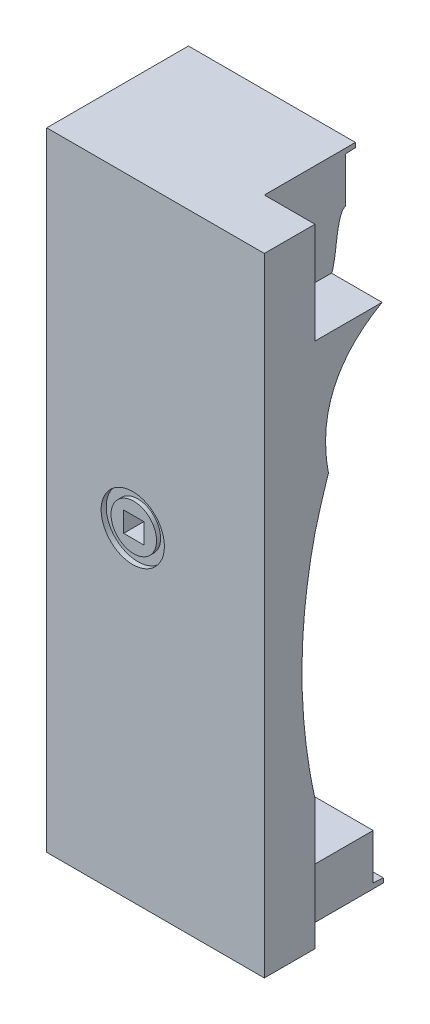
ISO-10303-21;
HEADER;
FILE_DESCRIPTION(('STEP AP214'),'2;1');
FILE_NAME('part.step','',(''),(''),'','','');
FILE_SCHEMA(('AUTOMOTIVE_DESIGN { 1 0 10303 214 1 1 1 1 }'));
ENDSEC;
DATA;
#1=APPLICATION_CONTEXT('core data for automotive mechanical design processes');
#2=APPLICATION_PROTOCOL_DEFINITION('international standard','automotive_design',2000,#1);
#3=PRODUCT_CONTEXT('',#1,'mechanical');
#4=PRODUCT('Part','Part','',(#3));
#5=PRODUCT_RELATED_PRODUCT_CATEGORY('part','',(#4));
#6=PRODUCT_DEFINITION_FORMATION('','',#4);
#7=PRODUCT_DEFINITION_CONTEXT('part definition',#1,'design');
#8=PRODUCT_DEFINITION('design','',#6,#7);
#9=PRODUCT_DEFINITION_SHAPE('','',#8);
#10=(LENGTH_UNIT() NAMED_UNIT(*) SI_UNIT(.MILLI.,.METRE.));
#11=(NAMED_UNIT(*) PLANE_ANGLE_UNIT() SI_UNIT($,.RADIAN.));
#12=(NAMED_UNIT(*) SI_UNIT($,.STERADIAN.) SOLID_ANGLE_UNIT());
#13=UNCERTAINTY_MEASURE_WITH_UNIT(LENGTH_MEASURE(1.E-05),#10,'distance_accuracy_value','');
#14=(GEOMETRIC_REPRESENTATION_CONTEXT(3) GLOBAL_UNCERTAINTY_ASSIGNED_CONTEXT((#13)) GLOBAL_UNIT_ASSIGNED_CONTEXT((#10,
#11,#12)) REPRESENTATION_CONTEXT('',''));
#15=CARTESIAN_POINT('',(0.,0.,0.));
#16=DIRECTION('',(0.,0.,1.));
#17=DIRECTION('',(1.,0.,0.));
#18=AXIS2_PLACEMENT_3D('',#15,#16,#17);
#19=CARTESIAN_POINT('',(0.,0.,26.));
#20=DIRECTION('',(0.,0.,1.));
#21=DIRECTION('',(1.,0.,0.));
#22=AXIS2_PLACEMENT_3D('',#19,#20,#21);
#23=PLANE('',#22);
#24=DIRECTION('',(0.,1.,0.));
#25=VECTOR('',#24,1.);
#26=CARTESIAN_POINT('',(38.5,0.,26.));
#27=LINE('',#26,#25);
#28=CARTESIAN_POINT('',(38.5,1.,26.));
#29=VERTEX_POINT('',#28);
#30=CARTESIAN_POINT('',(38.5,10.,26.));
#31=VERTEX_POINT('',#30);
#32=EDGE_CURVE('E296',#29,#31,#27,.T.);
#33=ORIENTED_EDGE('',*,*,#32,.F.);
#34=DIRECTION('',(-1.,0.,0.));
#35=VECTOR('',#34,1.);
#36=CARTESIAN_POINT('',(0.,1.,26.));
#37=LINE('',#36,#35);
#38=CARTESIAN_POINT('',(1.,1.,26.));
#39=VERTEX_POINT('',#38);
#40=EDGE_CURVE('E238',#29,#39,#37,.T.);
#41=ORIENTED_EDGE('',*,*,#40,.T.);
#42=DIRECTION('',(0.,-1.,0.));
#43=VECTOR('',#42,1.);
#44=CARTESIAN_POINT('',(1.,0.,26.));
#45=LINE('',#44,#43);
#46=CARTESIAN_POINT('',(0.999999999999972,123.,26.));
#47=VERTEX_POINT('',#46);
#48=EDGE_CURVE('E256',#47,#39,#45,.T.);
#49=ORIENTED_EDGE('',*,*,#48,.F.);
#50=DIRECTION('',(-1.,0.,0.));
#51=VECTOR('',#50,1.);
#52=CARTESIAN_POINT('',(0.,123.,26.));
#53=LINE('',#52,#51);
#54=CARTESIAN_POINT('',(33.,123.,26.));
#55=VERTEX_POINT('',#54);
#56=EDGE_CURVE('E254',#55,#47,#53,.T.);
#57=ORIENTED_EDGE('',*,*,#56,.F.);
#58=DIRECTION('',(0.,1.,0.));
#59=VECTOR('',#58,1.);
#60=CARTESIAN_POINT('',(33.,124.,26.));
#61=LINE('',#60,#59);
#62=CARTESIAN_POINT('',(33.,114.,26.));
#63=VERTEX_POINT('',#62);
#64=EDGE_CURVE('E305',#63,#55,#61,.T.);
#65=ORIENTED_EDGE('',*,*,#64,.F.);
#66=CARTESIAN_POINT('',(8.85,114.,26.));
#67=CARTESIAN_POINT('',(17.2833333333333,114.,26.));
#68=CARTESIAN_POINT('',(25.7166666666667,114.,26.));
#69=CARTESIAN_POINT('',(34.15,114.,26.));
#70=(BOUNDED_CURVE() B_SPLINE_CURVE(3,(#66,#67,#68,#69),.UNSPECIFIED.,.F.,
.F.) B_SPLINE_CURVE_WITH_KNOTS((4,4),(-0.02415,0.00115),
.UNSPECIFIED.) CURVE() GEOMETRIC_REPRESENTATION_ITEM() RATIONAL_B_SPLINE_CURVE((1.,1.,1.,1.)) REPRESENTATION_ITEM(''));
#71=CARTESIAN_POINT('',(10.,114.,26.));
#72=VERTEX_POINT('',#71);
#73=EDGE_CURVE('E274',#63,#72,#70,.F.);
#74=ORIENTED_EDGE('',*,*,#73,.T.);
#75=DIRECTION('',(0.,1.,0.));
#76=VECTOR('',#75,1.);
#77=CARTESIAN_POINT('',(10.,124.,26.));
#78=LINE('',#77,#76);
#79=CARTESIAN_POINT('',(10.,10.,26.));
#80=VERTEX_POINT('',#79);
#81=EDGE_CURVE('E282',#80,#72,#78,.T.);
#82=ORIENTED_EDGE('',*,*,#81,.F.);
#83=DIRECTION('',(-1.,0.,0.));
#84=VECTOR('',#83,1.);
#85=CARTESIAN_POINT('',(20.,10.,26.));
#86=LINE('',#85,#84);
#87=EDGE_CURVE('E277',#31,#80,#86,.T.);
#88=ORIENTED_EDGE('',*,*,#87,.F.);
#89=EDGE_LOOP('',(#33,#41,#49,#57,#65,#74,#82,#88));
#90=FACE_BOUND('',#89,.T.);
#91=ADVANCED_FACE('F37',(#90),#23,.F.);
#92=CARTESIAN_POINT('',(0.,0.,47.8));
#93=DIRECTION('',(0.,0.,-1.));
#94=DIRECTION('',(-1.,0.,0.));
#95=AXIS2_PLACEMENT_3D('',#92,#93,#94);
#96=PLANE('',#95);
#97=DIRECTION('',(0.,-1.,0.));
#98=VECTOR('',#97,1.);
#99=CARTESIAN_POINT('',(15.,62.,47.8));
#100=LINE('',#99,#98);
#101=CARTESIAN_POINT('',(15.,66.,47.8));
#102=VERTEX_POINT('',#101);
#103=CARTESIAN_POINT('',(15.,62.,47.8));
#104=VERTEX_POINT('',#103);
#105=EDGE_CURVE('E1106',#102,#104,#100,.T.);
#106=ORIENTED_EDGE('',*,*,#105,.T.);
#107=DIRECTION('',(1.,0.,0.));
#108=VECTOR('',#107,1.);
#109=CARTESIAN_POINT('',(15.,62.,47.8));
#110=LINE('',#109,#108);
#111=CARTESIAN_POINT('',(19.,62.,47.8));
#112=VERTEX_POINT('',#111);
#113=EDGE_CURVE('E1114',#104,#112,#110,.T.);
#114=ORIENTED_EDGE('',*,*,#113,.T.);
#115=DIRECTION('',(0.,1.,0.));
#116=VECTOR('',#115,1.);
#117=CARTESIAN_POINT('',(19.,62.,47.8));
#118=LINE('',#117,#116);
#119=CARTESIAN_POINT('',(19.,66.,47.8));
#120=VERTEX_POINT('',#119);
#121=EDGE_CURVE('E1111',#112,#120,#118,.T.);
#122=ORIENTED_EDGE('',*,*,#121,.T.);
#123=DIRECTION('',(-1.,0.,0.));
#124=VECTOR('',#123,1.);
#125=CARTESIAN_POINT('',(15.,66.,47.8));
#126=LINE('',#125,#124);
#127=EDGE_CURVE('E1098',#120,#102,#126,.T.);
#128=ORIENTED_EDGE('',*,*,#127,.T.);
#129=EDGE_LOOP('',(#106,#114,#122,#128));
#130=FACE_BOUND('',#129,.T.);
#131=ADVANCED_FACE('F397',(#130),#96,.F.);
#132=CARTESIAN_POINT('',(15.,62.,47.8));
#133=DIRECTION('',(0.,-1.,0.));
#134=DIRECTION('',(0.,0.,-1.));
#135=AXIS2_PLACEMENT_3D('',#132,#133,#134);
#136=PLANE('',#135);
#137=DIRECTION('',(1.,0.,0.));
#138=VECTOR('',#137,1.);
#139=CARTESIAN_POINT('',(15.,62.,51.8));
#140=LINE('',#139,#138);
#141=CARTESIAN_POINT('',(15.,62.,51.8));
#142=VERTEX_POINT('',#141);
#143=CARTESIAN_POINT('',(19.,62.,51.8));
#144=VERTEX_POINT('',#143);
#145=EDGE_CURVE('E47',#142,#144,#140,.T.);
#146=ORIENTED_EDGE('',*,*,#145,.T.);
#147=DIRECTION('',(0.,0.,1.));
#148=VECTOR('',#147,1.);
#149=CARTESIAN_POINT('',(19.,62.,47.8));
#150=LINE('',#149,#148);
#151=EDGE_CURVE('E56',#112,#144,#150,.T.);
#152=ORIENTED_EDGE('',*,*,#151,.F.);
#153=ORIENTED_EDGE('',*,*,#113,.F.);
#154=DIRECTION('',(0.,0.,1.));
#155=VECTOR('',#154,1.);
#156=CARTESIAN_POINT('',(15.,62.,47.8));
#157=LINE('',#156,#155);
#158=EDGE_CURVE('E76',#104,#142,#157,.T.);
#159=ORIENTED_EDGE('',*,*,#158,.T.);
#160=EDGE_LOOP('',(#146,#152,#153,#159));
#161=FACE_BOUND('',#160,.T.);
#162=ADVANCED_FACE('F760',(#161),#136,.F.);
#163=CARTESIAN_POINT('',(19.,62.,47.8));
#164=DIRECTION('',(1.,0.,0.));
#165=DIRECTION('',(0.,1.,0.));
#166=AXIS2_PLACEMENT_3D('',#163,#164,#165);
#167=PLANE('',#166);
#168=DIRECTION('',(0.,1.,0.));
#169=VECTOR('',#168,1.);
#170=CARTESIAN_POINT('',(19.,62.,51.8));
#171=LINE('',#170,#169);
#172=CARTESIAN_POINT('',(19.,66.,51.8));
#173=VERTEX_POINT('',#172);
#174=EDGE_CURVE('E1105',#144,#173,#171,.T.);
#175=ORIENTED_EDGE('',*,*,#174,.T.);
#176=DIRECTION('',(0.,0.,1.));
#177=VECTOR('',#176,1.);
#178=CARTESIAN_POINT('',(19.,66.,47.8));
#179=LINE('',#178,#177);
#180=EDGE_CURVE('E1100',#120,#173,#179,.T.);
#181=ORIENTED_EDGE('',*,*,#180,.F.);
#182=ORIENTED_EDGE('',*,*,#121,.F.);
#183=ORIENTED_EDGE('',*,*,#151,.T.);
#184=EDGE_LOOP('',(#175,#181,#182,#183));
#185=FACE_BOUND('',#184,.T.);
#186=ADVANCED_FACE('F765',(#185),#167,.F.);
#187=CARTESIAN_POINT('',(15.,66.,47.8));
#188=DIRECTION('',(0.,1.,0.));
#189=DIRECTION('',(0.,0.,1.));
#190=AXIS2_PLACEMENT_3D('',#187,#188,#189);
#191=PLANE('',#190);
#192=DIRECTION('',(-1.,0.,0.));
#193=VECTOR('',#192,1.);
#194=CARTESIAN_POINT('',(15.,66.,51.8));
#195=LINE('',#194,#193);
#196=CARTESIAN_POINT('',(15.,66.,51.8));
#197=VERTEX_POINT('',#196);
#198=EDGE_CURVE('E1103',#173,#197,#195,.T.);
#199=ORIENTED_EDGE('',*,*,#198,.T.);
#200=DIRECTION('',(0.,0.,1.));
#201=VECTOR('',#200,1.);
#202=CARTESIAN_POINT('',(15.,66.,47.8));
#203=LINE('',#202,#201);
#204=EDGE_CURVE('E78',#102,#197,#203,.T.);
#205=ORIENTED_EDGE('',*,*,#204,.F.);
#206=ORIENTED_EDGE('',*,*,#127,.F.);
#207=ORIENTED_EDGE('',*,*,#180,.T.);
#208=EDGE_LOOP('',(#199,#205,#206,#207));
#209=FACE_BOUND('',#208,.T.);
#210=ADVANCED_FACE('F948',(#209),#191,.F.);
#211=CARTESIAN_POINT('',(15.,62.,47.8));
#212=DIRECTION('',(-1.,0.,0.));
#213=DIRECTION('',(0.,0.,1.));
#214=AXIS2_PLACEMENT_3D('',#211,#212,#213);
#215=PLANE('',#214);
#216=DIRECTION('',(0.,-1.,0.));
#217=VECTOR('',#216,1.);
#218=CARTESIAN_POINT('',(15.,62.,51.8));
#219=LINE('',#218,#217);
#220=EDGE_CURVE('E12',#197,#142,#219,.T.);
#221=ORIENTED_EDGE('',*,*,#220,.T.);
#222=ORIENTED_EDGE('',*,*,#158,.F.);
#223=ORIENTED_EDGE('',*,*,#105,.F.);
#224=ORIENTED_EDGE('',*,*,#204,.T.);
#225=EDGE_LOOP('',(#221,#222,#223,#224));
#226=FACE_BOUND('',#225,.T.);
#227=ADVANCED_FACE('F957',(#226),#215,.F.);
#228=CARTESIAN_POINT('',(17.,64.,51.8));
#229=DIRECTION('',(0.,0.,1.));
#230=DIRECTION('',(1.,0.,0.));
#231=AXIS2_PLACEMENT_3D('',#228,#229,#230);
#232=PLANE('',#231);
#233=ORIENTED_EDGE('',*,*,#220,.F.);
#234=ORIENTED_EDGE('',*,*,#198,.F.);
#235=ORIENTED_EDGE('',*,*,#174,.F.);
#236=ORIENTED_EDGE('',*,*,#145,.F.);
#237=EDGE_LOOP('',(#233,#234,#235,#236));
#238=FACE_BOUND('',#237,.T.);
#239=CARTESIAN_POINT('',(17.,64.,51.8));
#240=DIRECTION('',(0.,0.,1.));
#241=DIRECTION('',(1.,0.,0.));
#242=AXIS2_PLACEMENT_3D('',#239,#240,#241);
#243=CIRCLE('',#242,4.50000000000001);
#244=CARTESIAN_POINT('',(21.5,64.,51.8));
#245=VERTEX_POINT('',#244);
#246=EDGE_CURVE('E1089',#245,#245,#243,.T.);
#247=ORIENTED_EDGE('',*,*,#246,.T.);
#248=EDGE_LOOP('',(#247));
#249=FACE_BOUND('',#248,.T.);
#250=ADVANCED_FACE('F966',(#238,#249),#232,.T.);
#251=CARTESIAN_POINT('',(17.,64.,51.8));
#252=DIRECTION('',(0.,0.,-1.));
#253=DIRECTION('',(-1.,0.,0.));
#254=AXIS2_PLACEMENT_3D('',#251,#252,#253);
#255=CYLINDRICAL_SURFACE('',#254,4.50000000000001);
#256=ORIENTED_EDGE('',*,*,#246,.F.);
#257=EDGE_LOOP('',(#256));
#258=FACE_BOUND('',#257,.T.);
#259=CARTESIAN_POINT('',(17.,64.,51.));
#260=DIRECTION('',(0.,0.,1.));
#261=DIRECTION('',(1.,0.,0.));
#262=AXIS2_PLACEMENT_3D('',#259,#260,#261);
#263=CIRCLE('',#262,4.50000000000001);
#264=CARTESIAN_POINT('',(21.5,64.,51.));
#265=VERTEX_POINT('',#264);
#266=EDGE_CURVE('E1091',#265,#265,#263,.T.);
#267=ORIENTED_EDGE('',*,*,#266,.T.);
#268=EDGE_LOOP('',(#267));
#269=FACE_BOUND('',#268,.T.);
#270=ADVANCED_FACE('F975',(#258,#269),#255,.T.);
#271=CARTESIAN_POINT('',(17.,64.,51.));
#272=DIRECTION('',(0.,0.,1.));
#273=DIRECTION('',(1.,0.,0.));
#274=AXIS2_PLACEMENT_3D('',#271,#272,#273);
#275=PLANE('',#274);
#276=ORIENTED_EDGE('',*,*,#266,.F.);
#277=EDGE_LOOP('',(#276));
#278=FACE_BOUND('',#277,.T.);
#279=CARTESIAN_POINT('',(17.,64.,51.));
#280=DIRECTION('',(0.,0.,1.));
#281=DIRECTION('',(1.,0.,0.));
#282=AXIS2_PLACEMENT_3D('',#279,#280,#281);
#283=CIRCLE('',#282,6.25);
#284=CARTESIAN_POINT('',(23.25,64.,51.));
#285=VERTEX_POINT('',#284);
#286=EDGE_CURVE('E348',#285,#285,#283,.T.);
#287=ORIENTED_EDGE('',*,*,#286,.T.);
#288=EDGE_LOOP('',(#287));
#289=FACE_BOUND('',#288,.T.);
#290=ADVANCED_FACE('F985',(#278,#289),#275,.T.);
#291=CARTESIAN_POINT('',(30.,94.0996130936417,38.2321283621869));
#292=DIRECTION('',(1.,0.,0.));
#293=DIRECTION('',(0.,0.,-1.));
#294=AXIS2_PLACEMENT_3D('',#291,#292,#293);
#295=PLANE('',#294);
#296=CARTESIAN_POINT('',(30.,104.,28.7385001548335));
#297=CARTESIAN_POINT('',(30.,96.157986727643,42.4312611242323));
#298=CARTESIAN_POINT('',(30.,80.0824789192807,39.3274910454495));
#299=B_SPLINE_CURVE_WITH_KNOTS('',2,(#296,#297,#298),.UNSPECIFIED.,.F.,.F.,(3,3),(0.,1.),.UNSPECIFIED.);
#300=CARTESIAN_POINT('',(30.,104.,28.7385001548439));
#301=VERTEX_POINT('',#300);
#302=CARTESIAN_POINT('',(30.,80.0824789188781,39.3274910453718));
#303=VERTEX_POINT('',#302);
#304=EDGE_CURVE('E346',#301,#303,#299,.T.);
#305=ORIENTED_EDGE('',*,*,#304,.T.);
#306=CARTESIAN_POINT('',(30.,71.1550742932118,42.));
#307=CARTESIAN_POINT('',(30.,88.4149281860878,37.4415976663728));
#308=CARTESIAN_POINT('',(30.,104.,28.7385001548336));
#309=B_SPLINE_CURVE_WITH_KNOTS('',2,(#306,#307,#308),.UNSPECIFIED.,.F.,.F.,(3,3),(0.,1.),.UNSPECIFIED.);
#310=EDGE_CURVE('E308',#301,#303,#309,.F.);
#311=ORIENTED_EDGE('',*,*,#310,.F.);
#312=EDGE_LOOP('',(#305,#311));
#313=FACE_BOUND('',#312,.T.);
#314=ADVANCED_FACE('F331',(#313),#295,.T.);
#315=CARTESIAN_POINT('',(17.,64.,51.));
#316=DIRECTION('',(0.,0.,1.));
#317=DIRECTION('',(1.,0.,0.));
#318=AXIS2_PLACEMENT_3D('',#315,#316,#317);
#319=CYLINDRICAL_SURFACE('',#318,6.25);
#320=ORIENTED_EDGE('',*,*,#286,.F.);
#321=EDGE_LOOP('',(#320));
#322=FACE_BOUND('',#321,.T.);
#323=CARTESIAN_POINT('',(17.,64.,52.));
#324=DIRECTION('',(0.,0.,1.));
#325=DIRECTION('',(1.,0.,0.));
#326=AXIS2_PLACEMENT_3D('',#323,#324,#325);
#327=CIRCLE('',#326,6.25);
#328=CARTESIAN_POINT('',(23.25,64.,52.));
#329=VERTEX_POINT('',#328);
#330=EDGE_CURVE('E340',#329,#329,#327,.T.);
#331=ORIENTED_EDGE('',*,*,#330,.T.);
#332=EDGE_LOOP('',(#331));
#333=FACE_BOUND('',#332,.T.);
#334=ADVANCED_FACE('F327',(#322,#333),#319,.F.);
#335=DIRECTION('',(1.,0.,0.));
#336=VECTOR('',#335,1.);
#337=SURFACE_OF_LINEAR_EXTRUSION('',#299,#336);
#338=DIRECTION('',(1.,0.,0.));
#339=VECTOR('',#338,1.);
#340=CARTESIAN_POINT('',(30.,80.082478918643,39.327491045456));
#341=LINE('',#340,#339);
#342=CARTESIAN_POINT('',(43.,80.082478918643,39.327491045456));
#343=VERTEX_POINT('',#342);
#344=EDGE_CURVE('E338',#303,#343,#341,.T.);
#345=ORIENTED_EDGE('',*,*,#344,.F.);
#346=ORIENTED_EDGE('',*,*,#304,.F.);
#347=CARTESIAN_POINT('',(30.,104.,28.7385001548335));
#348=DIRECTION('',(1.,0.,0.));
#349=VECTOR('',#348,1.);
#350=LINE('',#347,#349);
#351=CARTESIAN_POINT('',(33.,104.,28.7385001548439));
#352=VERTEX_POINT('',#351);
#353=EDGE_CURVE('E365',#301,#352,#350,.T.);
#354=ORIENTED_EDGE('',*,*,#353,.T.);
#355=DIRECTION('',(1.,0.,0.));
#356=VECTOR('',#355,1.);
#357=CARTESIAN_POINT('',(10.,104.,28.7385001548336));
#358=LINE('',#357,#356);
#359=CARTESIAN_POINT('',(43.,104.,28.7385001548439));
#360=VERTEX_POINT('',#359);
#361=EDGE_CURVE('E559',#352,#360,#358,.T.);
#362=ORIENTED_EDGE('',*,*,#361,.T.);
#363=CARTESIAN_POINT('',(43.,104.,28.7385001548335));
#364=CARTESIAN_POINT('',(43.,96.157986727643,42.4312611242323));
#365=CARTESIAN_POINT('',(43.,80.0824789192807,39.3274910454495));
#366=B_SPLINE_CURVE_WITH_KNOTS('',2,(#363,#364,#365),.UNSPECIFIED.,.F.,.F.,(3,3),(0.,1.),.UNSPECIFIED.);
#367=EDGE_CURVE('E584',#343,#360,#366,.F.);
#368=ORIENTED_EDGE('',*,*,#367,.F.);
#369=EDGE_LOOP('',(#345,#346,#354,#362,#368));
#370=FACE_BOUND('',#369,.T.);
#371=ADVANCED_FACE('F315',(#370),#337,.F.);
#372=CARTESIAN_POINT('',(10.,71.1550742932118,42.));
#373=CARTESIAN_POINT('',(10.,56.2449177380193,45.4167075591528));
#374=CARTESIAN_POINT('',(10.,41.1085749826265,45.4191520784882));
#375=CARTESIAN_POINT('',(10.,25.7460460270664,42.0073335579909));
#376=B_SPLINE_CURVE_WITH_KNOTS('',3,(#372,#373,#374,#375),.UNSPECIFIED.,.F.,.F.,(4,4),(0.,
0.573838037424879),.UNSPECIFIED.);
#377=DIRECTION('',(1.,0.,0.));
#378=VECTOR('',#377,1.);
#379=SURFACE_OF_LINEAR_EXTRUSION('',#376,#378);
#380=CARTESIAN_POINT('',(43.,71.1550742932118,42.));
#381=CARTESIAN_POINT('',(43.,56.2449177380193,45.4167075591528));
#382=CARTESIAN_POINT('',(43.,41.1085749826265,45.4191520784882));
#383=CARTESIAN_POINT('',(43.,25.7460460270664,42.0073335579909));
#384=B_SPLINE_CURVE_WITH_KNOTS('',3,(#380,#381,#382,#383),.UNSPECIFIED.,.F.,.F.,(4,4),(0.,
0.573838037424879),.UNSPECIFIED.);
#385=CARTESIAN_POINT('',(43.,71.1550742932118,42.));
#386=VERTEX_POINT('',#385);
#387=CARTESIAN_POINT('',(43.,25.7460460270664,42.0073335579909));
#388=VERTEX_POINT('',#387);
#389=EDGE_CURVE('E549',#386,#388,#384,.T.);
#390=ORIENTED_EDGE('',*,*,#389,.T.);
#391=DIRECTION('',(1.,0.,0.));
#392=VECTOR('',#391,1.);
#393=CARTESIAN_POINT('',(10.,25.7460460270664,42.0073335579909));
#394=LINE('',#393,#392);
#395=CARTESIAN_POINT('',(10.,25.7460460270664,42.0073335579909));
#396=VERTEX_POINT('',#395);
#397=EDGE_CURVE('E544',#396,#388,#394,.T.);
#398=ORIENTED_EDGE('',*,*,#397,.F.);
#399=CARTESIAN_POINT('',(10.,71.1550742932118,42.));
#400=VERTEX_POINT('',#399);
#401=EDGE_CURVE('E543',#400,#396,#376,.T.);
#402=ORIENTED_EDGE('',*,*,#401,.F.);
#403=DIRECTION('',(1.,0.,0.));
#404=VECTOR('',#403,1.);
#405=CARTESIAN_POINT('',(10.,71.1550742932118,42.));
#406=LINE('',#405,#404);
#407=EDGE_CURVE('E539',#400,#386,#406,.T.);
#408=ORIENTED_EDGE('',*,*,#407,.T.);
#409=EDGE_LOOP('',(#390,#398,#402,#408));
#410=FACE_BOUND('',#409,.T.);
#411=ADVANCED_FACE('F326',(#410),#379,.F.);
#412=CARTESIAN_POINT('',(10.,71.1550742932118,42.));
#413=CARTESIAN_POINT('',(10.,88.4149281860878,37.4415976663728));
#414=CARTESIAN_POINT('',(10.,104.,28.7385001548336));
#415=B_SPLINE_CURVE_WITH_KNOTS('',2,(#412,#413,#414),.UNSPECIFIED.,.F.,.F.,(3,3),(0.,1.),.UNSPECIFIED.);
#416=DIRECTION('',(1.,0.,0.));
#417=VECTOR('',#416,1.);
#418=SURFACE_OF_LINEAR_EXTRUSION('',#415,#417);
#419=ORIENTED_EDGE('',*,*,#344,.T.);
#420=CARTESIAN_POINT('',(43.,71.1550742932118,42.));
#421=CARTESIAN_POINT('',(43.,88.4149281860878,37.4415976663728));
#422=CARTESIAN_POINT('',(43.,104.,28.7385001548336));
#423=B_SPLINE_CURVE_WITH_KNOTS('',2,(#420,#421,#422),.UNSPECIFIED.,.F.,.F.,(3,3),(0.,1.),.UNSPECIFIED.);
#424=EDGE_CURVE('E580',#386,#343,#423,.T.);
#425=ORIENTED_EDGE('',*,*,#424,.F.);
#426=ORIENTED_EDGE('',*,*,#407,.F.);
#427=CARTESIAN_POINT('',(10.,104.,28.7385001548336));
#428=VERTEX_POINT('',#427);
#429=EDGE_CURVE('E591',#400,#428,#415,.T.);
#430=ORIENTED_EDGE('',*,*,#429,.T.);
#431=CARTESIAN_POINT('',(10.,104.,28.7385001548336));
#432=DIRECTION('',(1.,0.,0.));
#433=VECTOR('',#432,1.);
#434=LINE('',#431,#433);
#435=EDGE_CURVE('E438',#428,#301,#434,.T.);
#436=ORIENTED_EDGE('',*,*,#435,.T.);
#437=ORIENTED_EDGE('',*,*,#310,.T.);
#438=EDGE_LOOP('',(#419,#425,#426,#430,#436,#437));
#439=FACE_BOUND('',#438,.T.);
#440=ADVANCED_FACE('F567',(#439),#418,.T.);
#441=CARTESIAN_POINT('',(10.,25.7460460270664,42.0073335579909));
#442=DIRECTION('',(0.,-1.,0.));
#443=DIRECTION('',(1.,0.,0.));
#444=AXIS2_PLACEMENT_3D('',#441,#442,#443);
#445=PLANE('',#444);
#446=DIRECTION('',(0.,0.,1.));
#447=VECTOR('',#446,1.);
#448=CARTESIAN_POINT('',(38.5,25.7460460270664,52.));
#449=LINE('',#448,#447);
#450=CARTESIAN_POINT('',(38.5,25.746045360121,41.908487470257));
#451=VERTEX_POINT('',#450);
#452=CARTESIAN_POINT('',(38.5,25.7460460270664,42.));
#453=VERTEX_POINT('',#452);
#454=EDGE_CURVE('E535',#451,#453,#449,.T.);
#455=ORIENTED_EDGE('',*,*,#454,.F.);
#456=DIRECTION('',(1.,0.,0.));
#457=VECTOR('',#456,1.);
#458=CARTESIAN_POINT('',(24.25,25.7460460270664,41.90847221096));
#459=LINE('',#458,#457);
#460=CARTESIAN_POINT('',(10.,25.7460447630057,41.9085011242542));
#461=VERTEX_POINT('',#460);
#462=EDGE_CURVE('E358',#461,#451,#459,.T.);
#463=ORIENTED_EDGE('',*,*,#462,.F.);
#464=DIRECTION('',(0.,0.,-1.));
#465=VECTOR('',#464,1.);
#466=CARTESIAN_POINT('',(10.,25.7460460270664,42.0073335579909));
#467=LINE('',#466,#465);
#468=EDGE_CURVE('E540',#396,#461,#467,.T.);
#469=ORIENTED_EDGE('',*,*,#468,.F.);
#470=ORIENTED_EDGE('',*,*,#397,.T.);
#471=DIRECTION('',(0.,0.,-1.));
#472=VECTOR('',#471,1.);
#473=CARTESIAN_POINT('',(43.,25.7460460270664,42.0073335579909));
#474=LINE('',#473,#472);
#475=CARTESIAN_POINT('',(43.,25.7460460270664,42.));
#476=VERTEX_POINT('',#475);
#477=EDGE_CURVE('E558',#388,#476,#474,.T.);
#478=ORIENTED_EDGE('',*,*,#477,.T.);
#479=DIRECTION('',(1.,0.,0.));
#480=VECTOR('',#479,1.);
#481=CARTESIAN_POINT('',(20.,25.7460460270664,42.));
#482=LINE('',#481,#480);
#483=EDGE_CURVE('E532',#453,#476,#482,.T.);
#484=ORIENTED_EDGE('',*,*,#483,.F.);
#485=EDGE_LOOP('',(#455,#463,#469,#470,#478,#484));
#486=FACE_BOUND('',#485,.T.);
#487=ADVANCED_FACE('F569',(#486),#445,.F.);
#488=CARTESIAN_POINT('',(8.57500000000001,10.,38.));
#489=CARTESIAN_POINT('',(19.025,10.,38.));
#490=CARTESIAN_POINT('',(29.475,10.,38.));
#491=CARTESIAN_POINT('',(39.925,10.,38.));
#492=CARTESIAN_POINT('',(8.57500000000001,10.,42.));
#493=CARTESIAN_POINT('',(19.025,10.,42.));
#494=CARTESIAN_POINT('',(29.475,10.,42.));
#495=CARTESIAN_POINT('',(39.925,10.,42.));
#496=CARTESIAN_POINT('',(8.57500000000001,30.,42.));
#497=CARTESIAN_POINT('',(19.025,30.,42.));
#498=CARTESIAN_POINT('',(29.475,30.,42.));
#499=CARTESIAN_POINT('',(39.925,30.,42.));
#500=(BOUNDED_SURFACE() B_SPLINE_SURFACE(2,3,((#488,#489,#490,#491),(#492,#493,#494,#495),(#496,
#497,#498,#499)),.UNSPECIFIED.,.F.,.F.,.F.) B_SPLINE_SURFACE_WITH_KNOTS((3,3),(4,4),(0.,1.),
(-0.011425,0.019925),
.UNSPECIFIED.) GEOMETRIC_REPRESENTATION_ITEM() RATIONAL_B_SPLINE_SURFACE(((1.,1.,1.,1.),
(0.707106781186548,0.707106781186548,0.707106781186548,0.707106781186548),(1.,1.,1.,1.))) REPRESENTATION_ITEM('') SURFACE());
#501=CARTESIAN_POINT('',(10.,10.,38.));
#502=CARTESIAN_POINT('',(10.,10.,42.));
#503=CARTESIAN_POINT('',(10.,30.,42.));
#504=(BOUNDED_CURVE() B_SPLINE_CURVE(2,(#501,#502,#503),.UNSPECIFIED.,.F.,
.F.) B_SPLINE_CURVE_WITH_KNOTS((3,3),(0.,1.),
.UNSPECIFIED.) CURVE() GEOMETRIC_REPRESENTATION_ITEM() RATIONAL_B_SPLINE_CURVE((1.,
0.707106781186548,1.)) REPRESENTATION_ITEM(''));
#505=CARTESIAN_POINT('',(10.,10.,38.));
#506=VERTEX_POINT('',#505);
#507=EDGE_CURVE('E456',#461,#506,#504,.F.);
#508=CARTESIAN_POINT('',(38.5,30.,42.));
#509=CARTESIAN_POINT('',(38.5,10.,42.));
#510=CARTESIAN_POINT('',(38.5,10.,38.));
#511=(BOUNDED_CURVE() B_SPLINE_CURVE(2,(#508,#509,#510),.UNSPECIFIED.,.F.,
.F.) B_SPLINE_CURVE_WITH_KNOTS((3,3),(0.,1.),
.UNSPECIFIED.) CURVE() GEOMETRIC_REPRESENTATION_ITEM() RATIONAL_B_SPLINE_CURVE((1.,
0.707106781186548,1.)) REPRESENTATION_ITEM(''));
#512=CARTESIAN_POINT('',(38.5,10.,38.));
#513=VERTEX_POINT('',#512);
#514=EDGE_CURVE('E594',#513,#451,#511,.F.);
#515=CARTESIAN_POINT('',(39.925,10.,38.));
#516=CARTESIAN_POINT('',(29.475,10.,38.));
#517=CARTESIAN_POINT('',(19.025,10.,38.));
#518=CARTESIAN_POINT('',(8.57500000000001,10.,38.));
#519=(BOUNDED_CURVE() B_SPLINE_CURVE(3,(#515,#516,#517,#518),.UNSPECIFIED.,.F.,
.F.) B_SPLINE_CURVE_WITH_KNOTS((4,4),(-0.011425,0.019925),
.UNSPECIFIED.) CURVE() GEOMETRIC_REPRESENTATION_ITEM() RATIONAL_B_SPLINE_CURVE((1.,1.,1.,1.)) REPRESENTATION_ITEM(''));
#520=EDGE_CURVE('E503',#506,#513,#519,.F.);
#521=ORIENTED_EDGE('',*,*,#507,.F.);
#522=ORIENTED_EDGE('',*,*,#462,.T.);
#523=ORIENTED_EDGE('',*,*,#514,.F.);
#524=ORIENTED_EDGE('',*,*,#520,.F.);
#525=EDGE_LOOP('',(#521,#522,#523,#524));
#526=FACE_BOUND('',#525,.T.);
#527=ADVANCED_FACE('F399',(#526),#500,.T.);
#528=CARTESIAN_POINT('',(20.,30.,42.));
#529=DIRECTION('',(0.,0.,1.));
#530=DIRECTION('',(1.,0.,0.));
#531=AXIS2_PLACEMENT_3D('',#528,#529,#530);
#532=PLANE('',#531);
#533=DIRECTION('',(0.,1.,0.));
#534=VECTOR('',#533,1.);
#535=CARTESIAN_POINT('',(38.5,0.,42.));
#536=LINE('',#535,#534);
#537=CARTESIAN_POINT('',(38.5,0.,42.));
#538=VERTEX_POINT('',#537);
#539=EDGE_CURVE('E223',#538,#453,#536,.T.);
#540=ORIENTED_EDGE('',*,*,#539,.T.);
#541=ORIENTED_EDGE('',*,*,#483,.T.);
#542=DIRECTION('',(0.,1.,0.));
#543=VECTOR('',#542,1.);
#544=CARTESIAN_POINT('',(43.,124.,42.));
#545=LINE('',#544,#543);
#546=CARTESIAN_POINT('',(43.,0.,42.));
#547=VERTEX_POINT('',#546);
#548=EDGE_CURVE('E525',#547,#476,#545,.T.);
#549=ORIENTED_EDGE('',*,*,#548,.F.);
#550=DIRECTION('',(-1.,0.,0.));
#551=VECTOR('',#550,1.);
#552=CARTESIAN_POINT('',(43.,0.,42.));
#553=LINE('',#552,#551);
#554=EDGE_CURVE('E515',#547,#538,#553,.T.);
#555=ORIENTED_EDGE('',*,*,#554,.T.);
#556=EDGE_LOOP('',(#540,#541,#549,#555));
#557=FACE_BOUND('',#556,.T.);
#558=ADVANCED_FACE('F483',(#557),#532,.F.);
#559=CARTESIAN_POINT('',(38.5,0.,52.));
#560=DIRECTION('',(-1.,0.,0.));
#561=DIRECTION('',(0.,0.,1.));
#562=AXIS2_PLACEMENT_3D('',#559,#560,#561);
#563=PLANE('',#562);
#564=DIRECTION('',(0.,0.,-1.));
#565=VECTOR('',#564,1.);
#566=CARTESIAN_POINT('',(38.5,0.,52.));
#567=LINE('',#566,#565);
#568=CARTESIAN_POINT('',(38.5,0.,24.));
#569=VERTEX_POINT('',#568);
#570=EDGE_CURVE('E216',#538,#569,#567,.T.);
#571=ORIENTED_EDGE('',*,*,#570,.T.);
#572=DIRECTION('',(0.,1.,0.));
#573=VECTOR('',#572,1.);
#574=CARTESIAN_POINT('',(38.5,0.,24.));
#575=LINE('',#574,#573);
#576=CARTESIAN_POINT('',(38.5,0.895184441433918,24.));
#577=VERTEX_POINT('',#576);
#578=EDGE_CURVE('E219',#569,#577,#575,.T.);
#579=ORIENTED_EDGE('',*,*,#578,.T.);
#580=DIRECTION('',(0.,0.0523359562429438,0.998629534754574));
#581=VECTOR('',#580,1.);
#582=CARTESIAN_POINT('',(38.5,0.892732484416483,23.9532138729979));
#583=LINE('',#582,#581);
#584=EDGE_CURVE('E268',#577,#29,#583,.T.);
#585=ORIENTED_EDGE('',*,*,#584,.T.);
#586=ORIENTED_EDGE('',*,*,#32,.T.);
#587=DIRECTION('',(0.,0.,-1.));
#588=VECTOR('',#587,1.);
#589=CARTESIAN_POINT('',(38.5,10.,52.));
#590=LINE('',#589,#588);
#591=EDGE_CURVE('E228',#513,#31,#590,.T.);
#592=ORIENTED_EDGE('',*,*,#591,.F.);
#593=ORIENTED_EDGE('',*,*,#514,.T.);
#594=ORIENTED_EDGE('',*,*,#454,.T.);
#595=ORIENTED_EDGE('',*,*,#539,.F.);
#596=EDGE_LOOP('',(#571,#579,#585,#586,#592,#593,#594,#595));
#597=FACE_BOUND('',#596,.T.);
#598=ADVANCED_FACE('F218',(#597),#563,.F.);
#599=CARTESIAN_POINT('',(43.,0.,0.));
#600=DIRECTION('',(-1.,0.,0.));
#601=DIRECTION('',(0.,-1.,0.));
#602=AXIS2_PLACEMENT_3D('',#599,#600,#601);
#603=PLANE('',#602);
#604=ORIENTED_EDGE('',*,*,#424,.T.);
#605=ORIENTED_EDGE('',*,*,#367,.T.);
#606=DIRECTION('',(0.,0.,1.));
#607=VECTOR('',#606,1.);
#608=CARTESIAN_POINT('',(43.,104.,28.7385001548336));
#609=LINE('',#608,#607);
#610=CARTESIAN_POINT('',(43.,104.,42.));
#611=VERTEX_POINT('',#610);
#612=EDGE_CURVE('E592',#360,#611,#609,.T.);
#613=ORIENTED_EDGE('',*,*,#612,.T.);
#614=CARTESIAN_POINT('',(43.,124.,42.));
#615=VERTEX_POINT('',#614);
#616=EDGE_CURVE('E528',#611,#615,#545,.T.);
#617=ORIENTED_EDGE('',*,*,#616,.T.);
#618=DIRECTION('',(0.,0.,1.));
#619=VECTOR('',#618,1.);
#620=CARTESIAN_POINT('',(43.,124.,42.));
#621=LINE('',#620,#619);
#622=CARTESIAN_POINT('',(43.,124.,52.));
#623=VERTEX_POINT('',#622);
#624=EDGE_CURVE('E522',#615,#623,#621,.T.);
#625=ORIENTED_EDGE('',*,*,#624,.T.);
#626=DIRECTION('',(0.,-1.,0.));
#627=VECTOR('',#626,1.);
#628=CARTESIAN_POINT('',(43.,124.,52.));
#629=LINE('',#628,#627);
#630=CARTESIAN_POINT('',(43.,0.,52.));
#631=VERTEX_POINT('',#630);
#632=EDGE_CURVE('E519',#623,#631,#629,.T.);
#633=ORIENTED_EDGE('',*,*,#632,.T.);
#634=DIRECTION('',(0.,0.,-1.));
#635=VECTOR('',#634,1.);
#636=CARTESIAN_POINT('',(43.,0.,42.));
#637=LINE('',#636,#635);
#638=EDGE_CURVE('E517',#631,#547,#637,.T.);
#639=ORIENTED_EDGE('',*,*,#638,.T.);
#640=ORIENTED_EDGE('',*,*,#548,.T.);
#641=ORIENTED_EDGE('',*,*,#477,.F.);
#642=ORIENTED_EDGE('',*,*,#389,.F.);
#643=EDGE_LOOP('',(#604,#605,#613,#617,#625,#633,#639,#640,#641,#642));
#644=FACE_BOUND('',#643,.T.);
#645=ADVANCED_FACE('F482',(#644),#603,.F.);
#646=CARTESIAN_POINT('',(0.,0.,52.));
#647=DIRECTION('',(0.,0.,1.));
#648=DIRECTION('',(1.,0.,0.));
#649=AXIS2_PLACEMENT_3D('',#646,#647,#648);
#650=PLANE('',#649);
#651=ORIENTED_EDGE('',*,*,#330,.F.);
#652=EDGE_LOOP('',(#651));
#653=FACE_BOUND('',#652,.T.);
#654=DIRECTION('',(0.,-1.,0.));
#655=VECTOR('',#654,1.);
#656=CARTESIAN_POINT('',(0.,124.,52.));
#657=LINE('',#656,#655);
#658=CARTESIAN_POINT('',(0.,124.,52.));
#659=VERTEX_POINT('',#658);
#660=CARTESIAN_POINT('',(0.,0.,52.));
#661=VERTEX_POINT('',#660);
#662=EDGE_CURVE('E229',#659,#661,#657,.T.);
#663=ORIENTED_EDGE('',*,*,#662,.T.);
#664=DIRECTION('',(1.,0.,0.));
#665=VECTOR('',#664,1.);
#666=CARTESIAN_POINT('',(0.,0.,52.));
#667=LINE('',#666,#665);
#668=EDGE_CURVE('E612',#661,#631,#667,.T.);
#669=ORIENTED_EDGE('',*,*,#668,.T.);
#670=ORIENTED_EDGE('',*,*,#632,.F.);
#671=DIRECTION('',(-1.,0.,0.));
#672=VECTOR('',#671,1.);
#673=CARTESIAN_POINT('',(0.,124.,52.));
#674=LINE('',#673,#672);
#675=EDGE_CURVE('E609',#623,#659,#674,.T.);
#676=ORIENTED_EDGE('',*,*,#675,.T.);
#677=EDGE_LOOP('',(#663,#669,#670,#676));
#678=FACE_BOUND('',#677,.T.);
#679=ADVANCED_FACE('F484',(#653,#678),#650,.T.);
#680=CARTESIAN_POINT('',(0.,0.,10.));
#681=DIRECTION('',(-1.,0.,0.));
#682=DIRECTION('',(0.,-1.,0.));
#683=AXIS2_PLACEMENT_3D('',#680,#681,#682);
#684=PLANE('',#683);
#685=DIRECTION('',(0.,0.,-1.));
#686=VECTOR('',#685,1.);
#687=CARTESIAN_POINT('',(0.,124.,10.));
#688=LINE('',#687,#686);
#689=CARTESIAN_POINT('',(0.,124.,24.));
#690=VERTEX_POINT('',#689);
#691=EDGE_CURVE('E602',#659,#690,#688,.T.);
#692=ORIENTED_EDGE('',*,*,#691,.T.);
#693=DIRECTION('',(0.,1.,0.));
#694=VECTOR('',#693,1.);
#695=CARTESIAN_POINT('',(0.,0.,24.));
#696=LINE('',#695,#694);
#697=CARTESIAN_POINT('',(0.,0.,24.));
#698=VERTEX_POINT('',#697);
#699=EDGE_CURVE('E243',#698,#690,#696,.T.);
#700=ORIENTED_EDGE('',*,*,#699,.F.);
#701=DIRECTION('',(0.,0.,-1.));
#702=VECTOR('',#701,1.);
#703=CARTESIAN_POINT('',(0.,0.,10.));
#704=LINE('',#703,#702);
#705=EDGE_CURVE('E241',#661,#698,#704,.T.);
#706=ORIENTED_EDGE('',*,*,#705,.F.);
#707=ORIENTED_EDGE('',*,*,#662,.F.);
#708=EDGE_LOOP('',(#692,#700,#706,#707));
#709=FACE_BOUND('',#708,.T.);
#710=ADVANCED_FACE('F618',(#709),#684,.T.);
#711=CARTESIAN_POINT('',(10.,104.,28.7385001548336));
#712=DIRECTION('',(0.,1.,0.));
#713=DIRECTION('',(0.,0.,1.));
#714=AXIS2_PLACEMENT_3D('',#711,#712,#713);
#715=PLANE('',#714);
#716=DIRECTION('',(0.,0.,1.));
#717=VECTOR('',#716,1.);
#718=CARTESIAN_POINT('',(33.,104.,39.));
#719=LINE('',#718,#717);
#720=CARTESIAN_POINT('',(33.,104.,42.));
#721=VERTEX_POINT('',#720);
#722=EDGE_CURVE('E608',#352,#721,#719,.T.);
#723=ORIENTED_EDGE('',*,*,#722,.T.);
#724=DIRECTION('',(1.,0.,0.));
#725=VECTOR('',#724,1.);
#726=CARTESIAN_POINT('',(10.,104.,42.));
#727=LINE('',#726,#725);
#728=EDGE_CURVE('E634',#721,#611,#727,.T.);
#729=ORIENTED_EDGE('',*,*,#728,.T.);
#730=ORIENTED_EDGE('',*,*,#612,.F.);
#731=ORIENTED_EDGE('',*,*,#361,.F.);
#732=EDGE_LOOP('',(#723,#729,#730,#731));
#733=FACE_BOUND('',#732,.T.);
#734=ADVANCED_FACE('F329',(#733),#715,.T.);
#735=ORIENTED_EDGE('',*,*,#616,.F.);
#736=ORIENTED_EDGE('',*,*,#728,.F.);
#737=DIRECTION('',(0.,1.,0.));
#738=VECTOR('',#737,1.);
#739=CARTESIAN_POINT('',(33.,104.,42.));
#740=LINE('',#739,#738);
#741=CARTESIAN_POINT('',(33.,124.,42.));
#742=VERTEX_POINT('',#741);
#743=EDGE_CURVE('E529',#721,#742,#740,.T.);
#744=ORIENTED_EDGE('',*,*,#743,.T.);
#745=DIRECTION('',(-1.,0.,0.));
#746=VECTOR('',#745,1.);
#747=CARTESIAN_POINT('',(43.,124.,42.));
#748=LINE('',#747,#746);
#749=EDGE_CURVE('E512',#615,#742,#748,.T.);
#750=ORIENTED_EDGE('',*,*,#749,.F.);
#751=EDGE_LOOP('',(#735,#736,#744,#750));
#752=FACE_BOUND('',#751,.T.);
#753=ADVANCED_FACE('F631',(#752),#532,.F.);
#754=CARTESIAN_POINT('',(0.,124.,10.));
#755=DIRECTION('',(0.,1.,0.));
#756=DIRECTION('',(0.,0.,1.));
#757=AXIS2_PLACEMENT_3D('',#754,#755,#756);
#758=PLANE('',#757);
#759=DIRECTION('',(0.,0.,-1.));
#760=VECTOR('',#759,1.);
#761=CARTESIAN_POINT('',(33.,124.,39.));
#762=LINE('',#761,#760);
#763=CARTESIAN_POINT('',(33.,124.,24.));
#764=VERTEX_POINT('',#763);
#765=EDGE_CURVE('E604',#742,#764,#762,.T.);
#766=ORIENTED_EDGE('',*,*,#765,.T.);
#767=DIRECTION('',(1.,0.,0.));
#768=VECTOR('',#767,1.);
#769=CARTESIAN_POINT('',(0.,124.,24.));
#770=LINE('',#769,#768);
#771=EDGE_CURVE('E245',#690,#764,#770,.T.);
#772=ORIENTED_EDGE('',*,*,#771,.F.);
#773=ORIENTED_EDGE('',*,*,#691,.F.);
#774=ORIENTED_EDGE('',*,*,#675,.F.);
#775=ORIENTED_EDGE('',*,*,#624,.F.);
#776=ORIENTED_EDGE('',*,*,#749,.T.);
#777=EDGE_LOOP('',(#766,#772,#773,#774,#775,#776));
#778=FACE_BOUND('',#777,.T.);
#779=ADVANCED_FACE('F629',(#778),#758,.T.);
#780=CARTESIAN_POINT('',(10.,124.,52.));
#781=DIRECTION('',(-1.,0.,0.));
#782=DIRECTION('',(0.,-1.,0.));
#783=AXIS2_PLACEMENT_3D('',#780,#781,#782);
#784=PLANE('',#783);
#785=DIRECTION('',(0.,0.,1.));
#786=VECTOR('',#785,1.);
#787=CARTESIAN_POINT('',(10.,10.,-0.002000000000002));
#788=LINE('',#787,#786);
#789=EDGE_CURVE('E309',#80,#506,#788,.T.);
#790=ORIENTED_EDGE('',*,*,#789,.F.);
#791=ORIENTED_EDGE('',*,*,#81,.T.);
#792=CARTESIAN_POINT('',(10.,104.,28.));
#793=CARTESIAN_POINT('',(10.,114.,28.0000000000001));
#794=CARTESIAN_POINT('',(10.,114.,26.));
#795=(BOUNDED_CURVE() B_SPLINE_CURVE(2,(#792,#793,#794),.UNSPECIFIED.,.F.,
.F.) B_SPLINE_CURVE_WITH_KNOTS((3,3),(0.,1.),
.UNSPECIFIED.) CURVE() GEOMETRIC_REPRESENTATION_ITEM() RATIONAL_B_SPLINE_CURVE((1.,
0.707106781186545,1.)) REPRESENTATION_ITEM(''));
#796=CARTESIAN_POINT('',(10.,108.888621214896,27.744737786299));
#797=VERTEX_POINT('',#796);
#798=EDGE_CURVE('E598',#72,#797,#795,.F.);
#799=ORIENTED_EDGE('',*,*,#798,.T.);
#800=CARTESIAN_POINT('',(10.,104.,28.7385001548507));
#801=CARTESIAN_POINT('',(10.,104.000000000017,28.2926284314508));
#802=CARTESIAN_POINT('',(10.,108.888619487037,27.744722321872));
#803=(BOUNDED_CURVE() B_SPLINE_CURVE(2,(#800,#801,#802),.UNSPECIFIED.,.F.,
.F.) B_SPLINE_CURVE_WITH_KNOTS((3,3),(0.,1.),
.UNSPECIFIED.) CURVE() GEOMETRIC_REPRESENTATION_ITEM() RATIONAL_B_SPLINE_CURVE((1.,
0.745446347154539,1.)) REPRESENTATION_ITEM(''));
#804=EDGE_CURVE('E432',#797,#428,#803,.F.);
#805=ORIENTED_EDGE('',*,*,#804,.T.);
#806=ORIENTED_EDGE('',*,*,#429,.F.);
#807=ORIENTED_EDGE('',*,*,#401,.T.);
#808=ORIENTED_EDGE('',*,*,#468,.T.);
#809=ORIENTED_EDGE('',*,*,#507,.T.);
#810=EDGE_LOOP('',(#790,#791,#799,#805,#806,#807,#808,#809));
#811=FACE_BOUND('',#810,.T.);
#812=ADVANCED_FACE('F396',(#811),#784,.F.);
#813=CARTESIAN_POINT('',(34.15,108.888619487028,27.7447223218731));
#814=CARTESIAN_POINT('',(25.7166666666667,108.888619487274,27.7447223218455));
#815=CARTESIAN_POINT('',(17.2833333333333,108.888619487091,27.744722321866));
#816=CARTESIAN_POINT('',(8.85,108.888619487028,27.7447223218731));
#817=CARTESIAN_POINT('',(34.15,104.,28.2926284313861));
#818=CARTESIAN_POINT('',(25.7166666666667,104.000000000468,28.2926284312545));
#819=CARTESIAN_POINT('',(17.2833333333333,104.000000000117,28.2926284319128));
#820=CARTESIAN_POINT('',(8.85,104.,28.2926284313861));
#821=CARTESIAN_POINT('',(34.15,104.,28.7385001548569));
#822=CARTESIAN_POINT('',(25.7166666666667,104.,28.7385001547253));
#823=CARTESIAN_POINT('',(17.2833333333334,104.,28.738500154813));
#824=CARTESIAN_POINT('',(8.85,104.,28.7385001548569));
#825=(BOUNDED_SURFACE() B_SPLINE_SURFACE(2,3,((#813,#814,#815,#816),(#817,#818,#819,#820),(#821,
#822,#823,#824)),.UNSPECIFIED.,.F.,.F.,.F.) B_SPLINE_SURFACE_WITH_KNOTS((3,3),(4,4),(0.,1.),
(-0.01265,0.01265),
.UNSPECIFIED.) GEOMETRIC_REPRESENTATION_ITEM() RATIONAL_B_SPLINE_SURFACE(((1.,1.,1.,1.),
(0.745446347154539,0.745446347154539,0.745446347154539,0.745446347154539),(1.,1.,1.,1.))) REPRESENTATION_ITEM('') SURFACE());
#826=CARTESIAN_POINT('',(33.,108.888619487059,27.7447223218696));
#827=CARTESIAN_POINT('',(32.0416666666667,108.888619487058,27.7447223218697));
#828=CARTESIAN_POINT('',(31.0833333333333,108.888619487057,27.7447223218698));
#829=CARTESIAN_POINT('',(29.1666666666667,108.888619487055,27.74472232187));
#830=CARTESIAN_POINT('',(28.2083333333333,108.888619487054,27.7447223218701));
#831=CARTESIAN_POINT('',(26.2916666666667,108.888619487053,27.7447223218703));
#832=CARTESIAN_POINT('',(25.3333333333333,108.888619487052,27.7447223218704));
#833=CARTESIAN_POINT('',(23.4166666666667,108.88861948705,27.7447223218706));
#834=CARTESIAN_POINT('',(22.4583333333333,108.888619487049,27.7447223218707));
#835=CARTESIAN_POINT('',(20.5416666666667,108.888619487047,27.7447223218709));
#836=CARTESIAN_POINT('',(19.5833333333333,108.888619487046,27.744722321871));
#837=CARTESIAN_POINT('',(17.6666666666667,108.888619487044,27.7447223218712));
#838=CARTESIAN_POINT('',(16.7083333333333,108.888619487044,27.7447223218713));
#839=CARTESIAN_POINT('',(14.7916666666667,108.888619487042,27.7447223218715));
#840=CARTESIAN_POINT('',(13.8333333333333,108.888619487041,27.7447223218716));
#841=CARTESIAN_POINT('',(11.9166666666667,108.888619487039,27.7447223218718));
#842=CARTESIAN_POINT('',(10.9583333333333,108.888619487038,27.7447223218719));
#843=CARTESIAN_POINT('',(10.,108.888619487037,27.744722321872));
#844=B_SPLINE_CURVE_WITH_KNOTS('',3,(#826,#827,#828,#829,#830,#831,#832,#833,#834,#835,#836,
#837,#838,#839,#840,#841,#842,#843),.UNSPECIFIED.,.F.,.F.,(4,2,2,2,2,2,2,2,4),(0.,
2.87499999999998,5.74999999999998,8.62499999999997,11.5,14.375,17.25,20.125,23.),.UNSPECIFIED.);
#845=CARTESIAN_POINT('',(33.,108.888621053008,27.7447363460717));
#846=VERTEX_POINT('',#845);
#847=EDGE_CURVE('E428',#846,#797,#844,.T.);
#848=CARTESIAN_POINT('',(33.,108.888619487059,27.7447223218696));
#849=CARTESIAN_POINT('',(33.,104.000000000059,28.2926284313729));
#850=CARTESIAN_POINT('',(33.,104.,28.7385001548403));
#851=(BOUNDED_CURVE() B_SPLINE_CURVE(2,(#848,#849,#850),.UNSPECIFIED.,.F.,
.F.) B_SPLINE_CURVE_WITH_KNOTS((3,3),(0.,1.),
.UNSPECIFIED.) CURVE() GEOMETRIC_REPRESENTATION_ITEM() RATIONAL_B_SPLINE_CURVE((1.,
0.745446347154539,1.)) REPRESENTATION_ITEM(''));
#852=EDGE_CURVE('E429',#352,#846,#851,.F.);
#853=ORIENTED_EDGE('',*,*,#804,.F.);
#854=ORIENTED_EDGE('',*,*,#847,.F.);
#855=ORIENTED_EDGE('',*,*,#852,.F.);
#856=ORIENTED_EDGE('',*,*,#353,.F.);
#857=ORIENTED_EDGE('',*,*,#435,.F.);
#858=EDGE_LOOP('',(#853,#854,#855,#856,#857));
#859=FACE_BOUND('',#858,.T.);
#860=ADVANCED_FACE('F380',(#859),#825,.T.);
#861=CARTESIAN_POINT('',(33.,124.,39.));
#862=DIRECTION('',(-1.,0.,0.));
#863=DIRECTION('',(0.,-1.,0.));
#864=AXIS2_PLACEMENT_3D('',#861,#862,#863);
#865=PLANE('',#864);
#866=CARTESIAN_POINT('',(33.,114.,26.));
#867=CARTESIAN_POINT('',(33.,114.,28.0000000000001));
#868=CARTESIAN_POINT('',(33.,104.,28.));
#869=(BOUNDED_CURVE() B_SPLINE_CURVE(2,(#866,#867,#868),.UNSPECIFIED.,.F.,
.F.) B_SPLINE_CURVE_WITH_KNOTS((3,3),(0.,1.),
.UNSPECIFIED.) CURVE() GEOMETRIC_REPRESENTATION_ITEM() RATIONAL_B_SPLINE_CURVE((1.,
0.707106781186545,1.)) REPRESENTATION_ITEM(''));
#870=EDGE_CURVE('E595',#846,#63,#869,.F.);
#871=ORIENTED_EDGE('',*,*,#870,.T.);
#872=ORIENTED_EDGE('',*,*,#64,.T.);
#873=DIRECTION('',(0.,0.0523359562429438,-0.998629534754574));
#874=VECTOR('',#873,1.);
#875=CARTESIAN_POINT('',(33.,123.107267515584,23.9532138729979));
#876=LINE('',#875,#874);
#877=CARTESIAN_POINT('',(33.,123.104815558566,24.));
#878=VERTEX_POINT('',#877);
#879=EDGE_CURVE('E266',#878,#55,#876,.F.);
#880=ORIENTED_EDGE('',*,*,#879,.F.);
#881=DIRECTION('',(0.,1.,0.));
#882=VECTOR('',#881,1.);
#883=CARTESIAN_POINT('',(33.,124.,24.));
#884=LINE('',#883,#882);
#885=EDGE_CURVE('E250',#878,#764,#884,.T.);
#886=ORIENTED_EDGE('',*,*,#885,.T.);
#887=ORIENTED_EDGE('',*,*,#765,.F.);
#888=ORIENTED_EDGE('',*,*,#743,.F.);
#889=ORIENTED_EDGE('',*,*,#722,.F.);
#890=ORIENTED_EDGE('',*,*,#852,.T.);
#891=EDGE_LOOP('',(#871,#872,#880,#886,#887,#888,#889,#890));
#892=FACE_BOUND('',#891,.T.);
#893=ADVANCED_FACE('F395',(#892),#865,.F.);
#894=CARTESIAN_POINT('',(34.15,114.,26.));
#895=CARTESIAN_POINT('',(25.7166666666667,114.,26.));
#896=CARTESIAN_POINT('',(17.2833333333333,114.,26.));
#897=CARTESIAN_POINT('',(8.85,114.,26.));
#898=CARTESIAN_POINT('',(34.15,114.,28.0000000000001));
#899=CARTESIAN_POINT('',(25.7166666666667,114.,28.0000000000001));
#900=CARTESIAN_POINT('',(17.2833333333333,114.,28.0000000000001));
#901=CARTESIAN_POINT('',(8.85,114.,28.0000000000001));
#902=CARTESIAN_POINT('',(34.15,104.,28.));
#903=CARTESIAN_POINT('',(25.7166666666667,104.,28.));
#904=CARTESIAN_POINT('',(17.2833333333333,104.,28.));
#905=CARTESIAN_POINT('',(8.85,104.,28.));
#906=(BOUNDED_SURFACE() B_SPLINE_SURFACE(2,3,((#894,#895,#896,#897),(#898,#899,#900,#901),(#902,
#903,#904,#905)),.UNSPECIFIED.,.F.,.F.,.F.) B_SPLINE_SURFACE_WITH_KNOTS((3,3),(4,4),(0.,1.),
(-0.02415,0.00115),
.UNSPECIFIED.) GEOMETRIC_REPRESENTATION_ITEM() RATIONAL_B_SPLINE_SURFACE(((1.,1.,1.,1.),
(0.707106781186545,0.707106781186545,0.707106781186545,0.707106781186545),(1.,1.,1.,1.))) REPRESENTATION_ITEM('') SURFACE());
#907=ORIENTED_EDGE('',*,*,#870,.F.);
#908=ORIENTED_EDGE('',*,*,#847,.T.);
#909=ORIENTED_EDGE('',*,*,#798,.F.);
#910=ORIENTED_EDGE('',*,*,#73,.F.);
#911=EDGE_LOOP('',(#907,#908,#909,#910));
#912=FACE_BOUND('',#911,.T.);
#913=ADVANCED_FACE('F657',(#912),#906,.T.);
#914=CARTESIAN_POINT('',(0.,0.,10.));
#915=DIRECTION('',(0.,1.,0.));
#916=DIRECTION('',(0.,0.,1.));
#917=AXIS2_PLACEMENT_3D('',#914,#915,#916);
#918=PLANE('',#917);
#919=ORIENTED_EDGE('',*,*,#705,.T.);
#920=DIRECTION('',(1.,0.,0.));
#921=VECTOR('',#920,1.);
#922=CARTESIAN_POINT('',(0.,0.,24.));
#923=LINE('',#922,#921);
#924=EDGE_CURVE('E235',#698,#569,#923,.T.);
#925=ORIENTED_EDGE('',*,*,#924,.T.);
#926=ORIENTED_EDGE('',*,*,#570,.F.);
#927=ORIENTED_EDGE('',*,*,#554,.F.);
#928=ORIENTED_EDGE('',*,*,#638,.F.);
#929=ORIENTED_EDGE('',*,*,#668,.F.);
#930=EDGE_LOOP('',(#919,#925,#926,#927,#928,#929));
#931=FACE_BOUND('',#930,.T.);
#932=ADVANCED_FACE('F39',(#931),#918,.F.);
#933=CARTESIAN_POINT('',(20.,10.,52.));
#934=DIRECTION('',(0.,-1.,0.));
#935=DIRECTION('',(0.,0.,-1.));
#936=AXIS2_PLACEMENT_3D('',#933,#934,#935);
#937=PLANE('',#936);
#938=ORIENTED_EDGE('',*,*,#591,.T.);
#939=ORIENTED_EDGE('',*,*,#87,.T.);
#940=ORIENTED_EDGE('',*,*,#789,.T.);
#941=ORIENTED_EDGE('',*,*,#520,.T.);
#942=EDGE_LOOP('',(#938,#939,#940,#941));
#943=FACE_BOUND('',#942,.T.);
#944=ADVANCED_FACE('F486',(#943),#937,.F.);
#945=CARTESIAN_POINT('',(0.,1.,26.));
#946=DIRECTION('',(0.,0.998629534754574,-0.0523359562429438));
#947=DIRECTION('',(0.,0.0523359562429438,0.998629534754574));
#948=AXIS2_PLACEMENT_3D('',#945,#946,#947);
#949=PLANE('',#948);
#950=ORIENTED_EDGE('',*,*,#40,.F.);
#951=ORIENTED_EDGE('',*,*,#584,.F.);
#952=DIRECTION('',(-1.,0.,0.));
#953=VECTOR('',#952,1.);
#954=CARTESIAN_POINT('',(0.,0.895184441433918,24.));
#955=LINE('',#954,#953);
#956=CARTESIAN_POINT('',(0.895184441433917,0.895184441433918,24.));
#957=VERTEX_POINT('',#956);
#958=EDGE_CURVE('E237',#577,#957,#955,.T.);
#959=ORIENTED_EDGE('',*,*,#958,.T.);
#960=DIRECTION('',(-0.0522644276887139,-0.0522644276887139,-0.997264688634237));
#961=VECTOR('',#960,1.);
#962=CARTESIAN_POINT('',(0.997268429598371,0.997268429598371,25.9478785317944));
#963=LINE('',#962,#961);
#964=EDGE_CURVE('E261',#957,#39,#963,.F.);
#965=ORIENTED_EDGE('',*,*,#964,.T.);
#966=EDGE_LOOP('',(#950,#951,#959,#965));
#967=FACE_BOUND('',#966,.T.);
#968=ADVANCED_FACE('F490',(#967),#949,.T.);
#969=CARTESIAN_POINT('',(0.,123.,26.));
#970=DIRECTION('',(0.,-0.998629534754574,-0.0523359562429438));
#971=DIRECTION('',(0.,0.0523359562429438,-0.998629534754574));
#972=AXIS2_PLACEMENT_3D('',#969,#970,#971);
#973=PLANE('',#972);
#974=ORIENTED_EDGE('',*,*,#56,.T.);
#975=DIRECTION('',(0.0522644276887139,-0.0522644276887139,0.997264688634237));
#976=VECTOR('',#975,1.);
#977=CARTESIAN_POINT('',(0.997268429598344,123.002731570402,25.9478785317944));
#978=LINE('',#977,#976);
#979=CARTESIAN_POINT('',(0.89518444143389,123.104815558566,24.));
#980=VERTEX_POINT('',#979);
#981=EDGE_CURVE('E263',#980,#47,#978,.T.);
#982=ORIENTED_EDGE('',*,*,#981,.F.);
#983=DIRECTION('',(1.,0.,0.));
#984=VECTOR('',#983,1.);
#985=CARTESIAN_POINT('',(0.,123.104815558566,24.));
#986=LINE('',#985,#984);
#987=EDGE_CURVE('E253',#878,#980,#986,.F.);
#988=ORIENTED_EDGE('',*,*,#987,.F.);
#989=ORIENTED_EDGE('',*,*,#879,.T.);
#990=EDGE_LOOP('',(#974,#982,#988,#989));
#991=FACE_BOUND('',#990,.T.);
#992=ADVANCED_FACE('F642',(#991),#973,.T.);
#993=CARTESIAN_POINT('',(1.,0.,26.));
#994=DIRECTION('',(0.998629534754574,0.,-0.0523359562429438));
#995=DIRECTION('',(-0.0523359562429438,0.,-0.998629534754574));
#996=AXIS2_PLACEMENT_3D('',#993,#994,#995);
#997=PLANE('',#996);
#998=ORIENTED_EDGE('',*,*,#48,.T.);
#999=ORIENTED_EDGE('',*,*,#964,.F.);
#1000=DIRECTION('',(0.,1.,0.));
#1001=VECTOR('',#1000,1.);
#1002=CARTESIAN_POINT('',(0.895184441433918,0.,24.));
#1003=LINE('',#1002,#1001);
#1004=EDGE_CURVE('E270',#980,#957,#1003,.F.);
#1005=ORIENTED_EDGE('',*,*,#1004,.F.);
#1006=ORIENTED_EDGE('',*,*,#981,.T.);
#1007=EDGE_LOOP('',(#998,#999,#1005,#1006));
#1008=FACE_BOUND('',#1007,.T.);
#1009=ADVANCED_FACE('F646',(#1008),#997,.T.);
#1010=CARTESIAN_POINT('',(0.,0.,24.));
#1011=DIRECTION('',(0.,0.,1.));
#1012=DIRECTION('',(1.,0.,0.));
#1013=AXIS2_PLACEMENT_3D('',#1010,#1011,#1012);
#1014=PLANE('',#1013);
#1015=ORIENTED_EDGE('',*,*,#958,.F.);
#1016=ORIENTED_EDGE('',*,*,#578,.F.);
#1017=ORIENTED_EDGE('',*,*,#924,.F.);
#1018=ORIENTED_EDGE('',*,*,#699,.T.);
#1019=ORIENTED_EDGE('',*,*,#771,.T.);
#1020=ORIENTED_EDGE('',*,*,#885,.F.);
#1021=ORIENTED_EDGE('',*,*,#987,.T.);
#1022=ORIENTED_EDGE('',*,*,#1004,.T.);
#1023=EDGE_LOOP('',(#1015,#1016,#1017,#1018,#1019,#1020,#1021,#1022));
#1024=FACE_BOUND('',#1023,.T.);
#1025=ADVANCED_FACE('F233',(#1024),#1014,.F.);
#1026=CLOSED_SHELL('',(#91,#131,#162,#186,#210,#227,#250,#270,#290,#314,#334,#371,#411,#440,
#487,#527,#558,#598,#645,#679,#710,#734,#753,#779,#812,#860,#893,#913,#932,#944,#968,#992,#1009,#1025));
#1027=MANIFOLD_SOLID_BREP('B2',#1026);
#1028=ADVANCED_BREP_SHAPE_REPRESENTATION('',(#18,#1027),#14);
#1029=SHAPE_DEFINITION_REPRESENTATION(#9,#1028);
ENDSEC;
END-ISO-10303-21;
